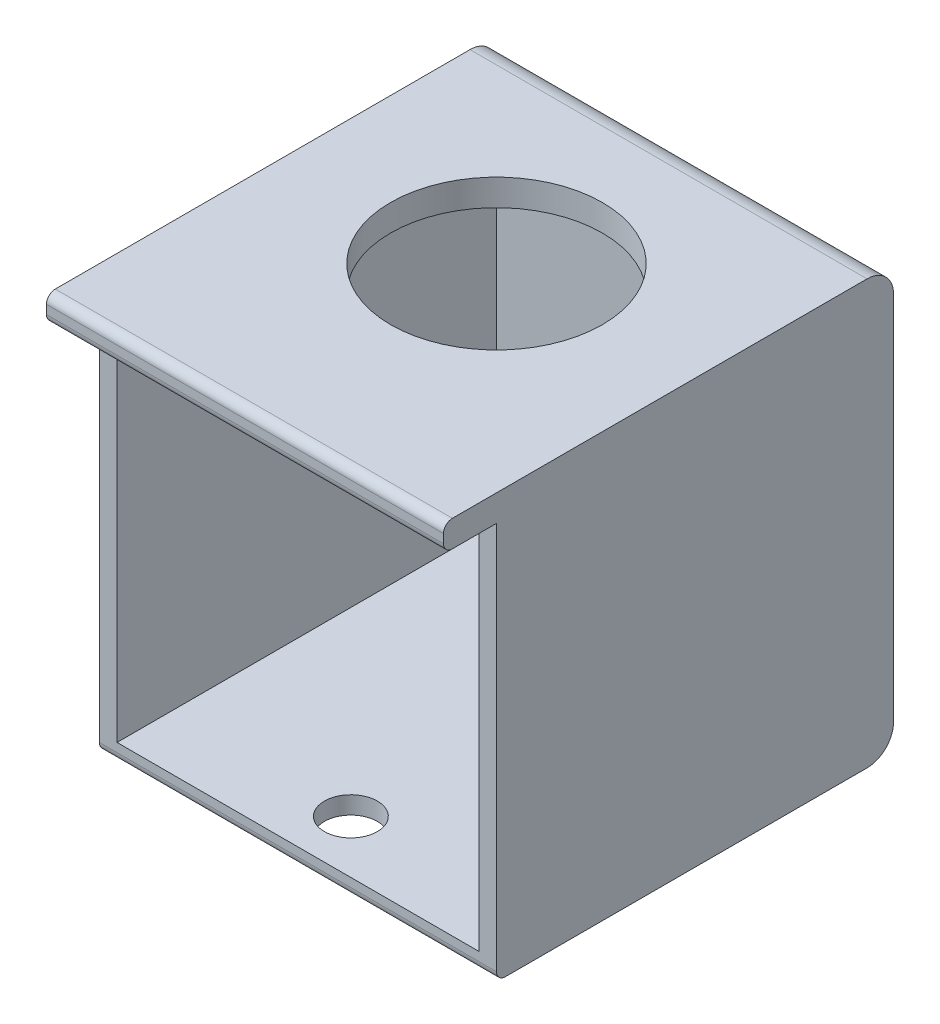
ISO-10303-21;
HEADER;
FILE_DESCRIPTION(('STEP AP214'),'2;1');
FILE_NAME('part.step','',(''),(''),'','','');
FILE_SCHEMA(('AUTOMOTIVE_DESIGN { 1 0 10303 214 1 1 1 1 }'));
ENDSEC;
DATA;
#1=APPLICATION_CONTEXT('core data for automotive mechanical design processes');
#2=APPLICATION_PROTOCOL_DEFINITION('international standard','automotive_design',2000,#1);
#3=PRODUCT_CONTEXT('',#1,'mechanical');
#4=PRODUCT('Part','Part','',(#3));
#5=PRODUCT_RELATED_PRODUCT_CATEGORY('part','',(#4));
#6=PRODUCT_DEFINITION_FORMATION('','',#4);
#7=PRODUCT_DEFINITION_CONTEXT('part definition',#1,'design');
#8=PRODUCT_DEFINITION('design','',#6,#7);
#9=PRODUCT_DEFINITION_SHAPE('','',#8);
#10=(LENGTH_UNIT() NAMED_UNIT(*) SI_UNIT(.MILLI.,.METRE.));
#11=(NAMED_UNIT(*) PLANE_ANGLE_UNIT() SI_UNIT($,.RADIAN.));
#12=(NAMED_UNIT(*) SI_UNIT($,.STERADIAN.) SOLID_ANGLE_UNIT());
#13=UNCERTAINTY_MEASURE_WITH_UNIT(LENGTH_MEASURE(1.E-05),#10,'distance_accuracy_value','');
#14=(GEOMETRIC_REPRESENTATION_CONTEXT(3) GLOBAL_UNCERTAINTY_ASSIGNED_CONTEXT((#13)) GLOBAL_UNIT_ASSIGNED_CONTEXT((#10,
#11,#12)) REPRESENTATION_CONTEXT('',''));
#15=CARTESIAN_POINT('',(0.,0.,0.));
#16=DIRECTION('',(0.,0.,1.));
#17=DIRECTION('',(1.,0.,0.));
#18=AXIS2_PLACEMENT_3D('',#15,#16,#17);
#19=CARTESIAN_POINT('',(-22.5,3.,22.5));
#20=DIRECTION('',(0.,0.,-1.));
#21=DIRECTION('',(-1.,0.,0.));
#22=AXIS2_PLACEMENT_3D('',#19,#20,#21);
#23=PLANE('',#22);
#24=DIRECTION('',(0.,-1.,0.));
#25=VECTOR('',#24,1.);
#26=CARTESIAN_POINT('',(-22.5,3.,22.5));
#27=LINE('',#26,#25);
#28=CARTESIAN_POINT('',(-22.5,0.,22.5));
#29=VERTEX_POINT('',#28);
#30=CARTESIAN_POINT('',(-22.5,-44.,22.5));
#31=VERTEX_POINT('',#30);
#32=EDGE_CURVE('E159',#29,#31,#27,.T.);
#33=ORIENTED_EDGE('',*,*,#32,.T.);
#34=DIRECTION('',(-1.,0.,0.));
#35=VECTOR('',#34,1.);
#36=CARTESIAN_POINT('',(22.5,-44.,22.5));
#37=LINE('',#36,#35);
#38=CARTESIAN_POINT('',(22.5,-44.,22.5));
#39=VERTEX_POINT('',#38);
#40=EDGE_CURVE('E46',#31,#39,#37,.F.);
#41=ORIENTED_EDGE('',*,*,#40,.T.);
#42=DIRECTION('',(0.,-1.,0.));
#43=VECTOR('',#42,1.);
#44=CARTESIAN_POINT('',(22.5,3.,22.5));
#45=LINE('',#44,#43);
#46=CARTESIAN_POINT('',(22.5,0.,22.5));
#47=VERTEX_POINT('',#46);
#48=EDGE_CURVE('E146',#47,#39,#45,.T.);
#49=ORIENTED_EDGE('',*,*,#48,.F.);
#50=DIRECTION('',(1.,0.,0.));
#51=VECTOR('',#50,1.);
#52=CARTESIAN_POINT('',(-22.5,0.,22.5));
#53=LINE('',#52,#51);
#54=CARTESIAN_POINT('',(20.5,0.,22.5));
#55=VERTEX_POINT('',#54);
#56=EDGE_CURVE('E157',#55,#47,#53,.T.);
#57=ORIENTED_EDGE('',*,*,#56,.F.);
#58=DIRECTION('',(0.,1.,0.));
#59=VECTOR('',#58,1.);
#60=CARTESIAN_POINT('',(20.5,-45.,22.5));
#61=LINE('',#60,#59);
#62=CARTESIAN_POINT('',(20.5,-43.,22.5));
#63=VERTEX_POINT('',#62);
#64=EDGE_CURVE('E255',#63,#55,#61,.T.);
#65=ORIENTED_EDGE('',*,*,#64,.F.);
#66=DIRECTION('',(-1.,0.,0.));
#67=VECTOR('',#66,1.);
#68=CARTESIAN_POINT('',(-20.5,-43.,22.5));
#69=LINE('',#68,#67);
#70=CARTESIAN_POINT('',(-20.5,-43.,22.5));
#71=VERTEX_POINT('',#70);
#72=EDGE_CURVE('E303',#63,#71,#69,.T.);
#73=ORIENTED_EDGE('',*,*,#72,.T.);
#74=DIRECTION('',(0.,1.,0.));
#75=VECTOR('',#74,1.);
#76=CARTESIAN_POINT('',(-20.5,-45.,22.5));
#77=LINE('',#76,#75);
#78=CARTESIAN_POINT('',(-20.5,0.,22.5));
#79=VERTEX_POINT('',#78);
#80=EDGE_CURVE('E249',#71,#79,#77,.T.);
#81=ORIENTED_EDGE('',*,*,#80,.T.);
#82=EDGE_CURVE('E170',#29,#79,#53,.T.);
#83=ORIENTED_EDGE('',*,*,#82,.F.);
#84=EDGE_LOOP('',(#33,#41,#49,#57,#65,#73,#81,#83));
#85=FACE_BOUND('',#84,.T.);
#86=ADVANCED_FACE('F38',(#85),#23,.F.);
#87=CARTESIAN_POINT('',(-20.5,-45.,22.5));
#88=DIRECTION('',(-1.,0.,0.));
#89=DIRECTION('',(0.,0.,1.));
#90=AXIS2_PLACEMENT_3D('',#87,#88,#89);
#91=PLANE('',#90);
#92=DIRECTION('',(0.,0.,-1.));
#93=VECTOR('',#92,1.);
#94=CARTESIAN_POINT('',(-20.5,-43.,22.5));
#95=LINE('',#94,#93);
#96=CARTESIAN_POINT('',(-20.5,-43.,-20.5));
#97=VERTEX_POINT('',#96);
#98=EDGE_CURVE('E300',#71,#97,#95,.T.);
#99=ORIENTED_EDGE('',*,*,#98,.T.);
#100=DIRECTION('',(0.,1.,0.));
#101=VECTOR('',#100,1.);
#102=CARTESIAN_POINT('',(-20.5,-45.,-20.5));
#103=LINE('',#102,#101);
#104=CARTESIAN_POINT('',(-20.5,0.,-20.5));
#105=VERTEX_POINT('',#104);
#106=EDGE_CURVE('E292',#97,#105,#103,.T.);
#107=ORIENTED_EDGE('',*,*,#106,.T.);
#108=DIRECTION('',(0.,0.,1.));
#109=VECTOR('',#108,1.);
#110=CARTESIAN_POINT('',(-20.5,0.,22.5));
#111=LINE('',#110,#109);
#112=EDGE_CURVE('E250',#105,#79,#111,.T.);
#113=ORIENTED_EDGE('',*,*,#112,.T.);
#114=ORIENTED_EDGE('',*,*,#80,.F.);
#115=EDGE_LOOP('',(#99,#107,#113,#114));
#116=FACE_BOUND('',#115,.T.);
#117=ADVANCED_FACE('F314',(#116),#91,.F.);
#118=CARTESIAN_POINT('',(20.5,-45.,22.5));
#119=DIRECTION('',(-1.,0.,0.));
#120=DIRECTION('',(0.,0.,1.));
#121=AXIS2_PLACEMENT_3D('',#118,#119,#120);
#122=PLANE('',#121);
#123=DIRECTION('',(0.,1.,0.));
#124=VECTOR('',#123,1.);
#125=CARTESIAN_POINT('',(20.5,-45.,-20.5));
#126=LINE('',#125,#124);
#127=CARTESIAN_POINT('',(20.5,-43.,-20.5));
#128=VERTEX_POINT('',#127);
#129=CARTESIAN_POINT('',(20.5,0.,-20.5));
#130=VERTEX_POINT('',#129);
#131=EDGE_CURVE('E288',#128,#130,#126,.T.);
#132=ORIENTED_EDGE('',*,*,#131,.F.);
#133=DIRECTION('',(0.,0.,-1.));
#134=VECTOR('',#133,1.);
#135=CARTESIAN_POINT('',(20.5,-43.,22.5));
#136=LINE('',#135,#134);
#137=EDGE_CURVE('E297',#63,#128,#136,.T.);
#138=ORIENTED_EDGE('',*,*,#137,.F.);
#139=ORIENTED_EDGE('',*,*,#64,.T.);
#140=DIRECTION('',(0.,0.,1.));
#141=VECTOR('',#140,1.);
#142=CARTESIAN_POINT('',(20.5,0.,22.5));
#143=LINE('',#142,#141);
#144=EDGE_CURVE('E166',#130,#55,#143,.T.);
#145=ORIENTED_EDGE('',*,*,#144,.F.);
#146=EDGE_LOOP('',(#132,#138,#139,#145));
#147=FACE_BOUND('',#146,.T.);
#148=ADVANCED_FACE('F319',(#147),#122,.T.);
#149=CARTESIAN_POINT('',(-20.5,-45.,-20.5));
#150=DIRECTION('',(0.,0.,-1.));
#151=DIRECTION('',(-1.,0.,0.));
#152=AXIS2_PLACEMENT_3D('',#149,#150,#151);
#153=PLANE('',#152);
#154=DIRECTION('',(-1.,0.,0.));
#155=VECTOR('',#154,1.);
#156=CARTESIAN_POINT('',(-20.5,-43.,-20.5));
#157=LINE('',#156,#155);
#158=EDGE_CURVE('E304',#128,#97,#157,.T.);
#159=ORIENTED_EDGE('',*,*,#158,.F.);
#160=ORIENTED_EDGE('',*,*,#131,.T.);
#161=DIRECTION('',(-1.,0.,0.));
#162=VECTOR('',#161,1.);
#163=CARTESIAN_POINT('',(-20.5,0.,-20.5));
#164=LINE('',#163,#162);
#165=EDGE_CURVE('E294',#130,#105,#164,.T.);
#166=ORIENTED_EDGE('',*,*,#165,.T.);
#167=ORIENTED_EDGE('',*,*,#106,.F.);
#168=EDGE_LOOP('',(#159,#160,#166,#167));
#169=FACE_BOUND('',#168,.T.);
#170=ADVANCED_FACE('F316',(#169),#153,.F.);
#171=CARTESIAN_POINT('',(0.,0.,0.));
#172=DIRECTION('',(0.,1.,0.));
#173=DIRECTION('',(0.,0.,1.));
#174=AXIS2_PLACEMENT_3D('',#171,#172,#173);
#175=PLANE('',#174);
#176=CARTESIAN_POINT('',(0.,0.,0.));
#177=DIRECTION('',(0.,1.,0.));
#178=DIRECTION('',(0.,0.,1.));
#179=AXIS2_PLACEMENT_3D('',#176,#177,#178);
#180=CIRCLE('',#179,12.);
#181=CARTESIAN_POINT('',(0.,0.,12.));
#182=VERTEX_POINT('',#181);
#183=EDGE_CURVE('E283',#182,#182,#180,.T.);
#184=ORIENTED_EDGE('',*,*,#183,.T.);
#185=EDGE_LOOP('',(#184));
#186=FACE_BOUND('',#185,.T.);
#187=DIRECTION('',(0.,0.,-1.));
#188=VECTOR('',#187,1.);
#189=CARTESIAN_POINT('',(22.5,0.,28.5));
#190=LINE('',#189,#188);
#191=CARTESIAN_POINT('',(22.5,0.,27.5));
#192=VERTEX_POINT('',#191);
#193=EDGE_CURVE('E144',#192,#47,#190,.T.);
#194=ORIENTED_EDGE('',*,*,#193,.F.);
#195=DIRECTION('',(1.,0.,0.));
#196=VECTOR('',#195,1.);
#197=CARTESIAN_POINT('',(-22.5,0.,27.5));
#198=LINE('',#197,#196);
#199=CARTESIAN_POINT('',(-22.5,0.,27.5));
#200=VERTEX_POINT('',#199);
#201=EDGE_CURVE('E209',#192,#200,#198,.F.);
#202=ORIENTED_EDGE('',*,*,#201,.T.);
#203=DIRECTION('',(0.,0.,-1.));
#204=VECTOR('',#203,1.);
#205=CARTESIAN_POINT('',(-22.5,0.,28.5));
#206=LINE('',#205,#204);
#207=EDGE_CURVE('E153',#200,#29,#206,.T.);
#208=ORIENTED_EDGE('',*,*,#207,.T.);
#209=ORIENTED_EDGE('',*,*,#82,.T.);
#210=ORIENTED_EDGE('',*,*,#112,.F.);
#211=ORIENTED_EDGE('',*,*,#165,.F.);
#212=ORIENTED_EDGE('',*,*,#144,.T.);
#213=ORIENTED_EDGE('',*,*,#56,.T.);
#214=EDGE_LOOP('',(#194,#202,#208,#209,#210,#211,#212,#213));
#215=FACE_BOUND('',#214,.T.);
#216=ADVANCED_FACE('F163',(#186,#215),#175,.F.);
#217=CARTESIAN_POINT('',(22.5,3.,-22.5));
#218=DIRECTION('',(-1.,0.,0.));
#219=DIRECTION('',(0.,0.,1.));
#220=AXIS2_PLACEMENT_3D('',#217,#218,#219);
#221=PLANE('',#220);
#222=ORIENTED_EDGE('',*,*,#48,.T.);
#223=CARTESIAN_POINT('',(22.5,-44.,21.5));
#224=DIRECTION('',(-1.,0.,0.));
#225=DIRECTION('',(0.,0.,1.));
#226=AXIS2_PLACEMENT_3D('',#223,#224,#225);
#227=CIRCLE('',#226,1.);
#228=CARTESIAN_POINT('',(22.5,-45.,21.5));
#229=VERTEX_POINT('',#228);
#230=EDGE_CURVE('E11',#39,#229,#227,.F.);
#231=ORIENTED_EDGE('',*,*,#230,.T.);
#232=DIRECTION('',(0.,0.,-1.));
#233=VECTOR('',#232,1.);
#234=CARTESIAN_POINT('',(22.5,-45.,22.5));
#235=LINE('',#234,#233);
#236=CARTESIAN_POINT('',(22.5,-45.,-19.5));
#237=VERTEX_POINT('',#236);
#238=EDGE_CURVE('E243',#229,#237,#235,.T.);
#239=ORIENTED_EDGE('',*,*,#238,.T.);
#240=CARTESIAN_POINT('',(22.5,-42.,-19.5));
#241=DIRECTION('',(-1.,0.,0.));
#242=DIRECTION('',(0.,0.,1.));
#243=AXIS2_PLACEMENT_3D('',#240,#241,#242);
#244=CIRCLE('',#243,3.);
#245=CARTESIAN_POINT('',(22.5,-42.,-22.5));
#246=VERTEX_POINT('',#245);
#247=EDGE_CURVE('E221',#237,#246,#244,.F.);
#248=ORIENTED_EDGE('',*,*,#247,.T.);
#249=DIRECTION('',(0.,-1.,0.));
#250=VECTOR('',#249,1.);
#251=CARTESIAN_POINT('',(22.5,3.,-22.5));
#252=LINE('',#251,#250);
#253=CARTESIAN_POINT('',(22.5,0.,-22.5));
#254=VERTEX_POINT('',#253);
#255=EDGE_CURVE('E168',#254,#246,#252,.T.);
#256=ORIENTED_EDGE('',*,*,#255,.F.);
#257=CARTESIAN_POINT('',(22.5,0.,-19.5));
#258=DIRECTION('',(-1.,0.,0.));
#259=DIRECTION('',(0.,0.,1.));
#260=AXIS2_PLACEMENT_3D('',#257,#258,#259);
#261=CIRCLE('',#260,3.);
#262=CARTESIAN_POINT('',(22.5,3.,-19.5));
#263=VERTEX_POINT('',#262);
#264=EDGE_CURVE('E219',#254,#263,#261,.F.);
#265=ORIENTED_EDGE('',*,*,#264,.T.);
#266=DIRECTION('',(0.,0.,-1.));
#267=VECTOR('',#266,1.);
#268=CARTESIAN_POINT('',(22.5,3.,-22.5));
#269=LINE('',#268,#267);
#270=CARTESIAN_POINT('',(22.5,3.,27.5));
#271=VERTEX_POINT('',#270);
#272=EDGE_CURVE('E252',#271,#263,#269,.T.);
#273=ORIENTED_EDGE('',*,*,#272,.F.);
#274=CARTESIAN_POINT('',(22.5,2.,27.5));
#275=DIRECTION('',(-1.,0.,0.));
#276=DIRECTION('',(0.,0.,1.));
#277=AXIS2_PLACEMENT_3D('',#274,#275,#276);
#278=CIRCLE('',#277,1.);
#279=CARTESIAN_POINT('',(22.5,2.,28.5));
#280=VERTEX_POINT('',#279);
#281=EDGE_CURVE('E203',#271,#280,#278,.F.);
#282=ORIENTED_EDGE('',*,*,#281,.T.);
#283=DIRECTION('',(0.,1.,0.));
#284=VECTOR('',#283,1.);
#285=CARTESIAN_POINT('',(22.5,3.,28.5));
#286=LINE('',#285,#284);
#287=CARTESIAN_POINT('',(22.5,1.,28.5));
#288=VERTEX_POINT('',#287);
#289=EDGE_CURVE('E154',#288,#280,#286,.T.);
#290=ORIENTED_EDGE('',*,*,#289,.F.);
#291=CARTESIAN_POINT('',(22.5,1.,27.5));
#292=DIRECTION('',(-1.,0.,0.));
#293=DIRECTION('',(0.,0.,1.));
#294=AXIS2_PLACEMENT_3D('',#291,#292,#293);
#295=CIRCLE('',#294,1.);
#296=EDGE_CURVE('E149',#288,#192,#295,.F.);
#297=ORIENTED_EDGE('',*,*,#296,.T.);
#298=ORIENTED_EDGE('',*,*,#193,.T.);
#299=EDGE_LOOP('',(#222,#231,#239,#248,#256,#265,#273,#282,#290,#297,#298));
#300=FACE_BOUND('',#299,.T.);
#301=ADVANCED_FACE('F145',(#300),#221,.F.);
#302=CARTESIAN_POINT('',(-22.5,3.,-22.5));
#303=DIRECTION('',(0.,0.,1.));
#304=DIRECTION('',(1.,0.,0.));
#305=AXIS2_PLACEMENT_3D('',#302,#303,#304);
#306=PLANE('',#305);
#307=ORIENTED_EDGE('',*,*,#255,.T.);
#308=DIRECTION('',(1.,0.,0.));
#309=VECTOR('',#308,1.);
#310=CARTESIAN_POINT('',(-22.5,-42.,-22.5));
#311=LINE('',#310,#309);
#312=CARTESIAN_POINT('',(-22.5,-42.,-22.5));
#313=VERTEX_POINT('',#312);
#314=EDGE_CURVE('E225',#246,#313,#311,.F.);
#315=ORIENTED_EDGE('',*,*,#314,.T.);
#316=DIRECTION('',(0.,-1.,0.));
#317=VECTOR('',#316,1.);
#318=CARTESIAN_POINT('',(-22.5,3.,-22.5));
#319=LINE('',#318,#317);
#320=CARTESIAN_POINT('',(-22.5,0.,-22.5));
#321=VERTEX_POINT('',#320);
#322=EDGE_CURVE('E175',#321,#313,#319,.T.);
#323=ORIENTED_EDGE('',*,*,#322,.F.);
#324=DIRECTION('',(-1.,0.,0.));
#325=VECTOR('',#324,1.);
#326=CARTESIAN_POINT('',(22.5,0.,-22.5));
#327=LINE('',#326,#325);
#328=EDGE_CURVE('E223',#321,#254,#327,.F.);
#329=ORIENTED_EDGE('',*,*,#328,.T.);
#330=EDGE_LOOP('',(#307,#315,#323,#329));
#331=FACE_BOUND('',#330,.T.);
#332=ADVANCED_FACE('F277',(#331),#306,.F.);
#333=CARTESIAN_POINT('',(-22.5,3.,-22.5));
#334=DIRECTION('',(1.,0.,0.));
#335=DIRECTION('',(0.,0.,-1.));
#336=AXIS2_PLACEMENT_3D('',#333,#334,#335);
#337=PLANE('',#336);
#338=DIRECTION('',(0.,0.,-1.));
#339=VECTOR('',#338,1.);
#340=CARTESIAN_POINT('',(-22.5,-45.,22.5));
#341=LINE('',#340,#339);
#342=CARTESIAN_POINT('',(-22.5,-45.,21.5));
#343=VERTEX_POINT('',#342);
#344=CARTESIAN_POINT('',(-22.5,-45.,-19.5));
#345=VERTEX_POINT('',#344);
#346=EDGE_CURVE('E242',#343,#345,#341,.T.);
#347=ORIENTED_EDGE('',*,*,#346,.F.);
#348=CARTESIAN_POINT('',(-22.5,-44.,21.5));
#349=DIRECTION('',(1.,0.,0.));
#350=DIRECTION('',(0.,0.,-1.));
#351=AXIS2_PLACEMENT_3D('',#348,#349,#350);
#352=CIRCLE('',#351,1.);
#353=EDGE_CURVE('E60',#343,#31,#352,.F.);
#354=ORIENTED_EDGE('',*,*,#353,.T.);
#355=ORIENTED_EDGE('',*,*,#32,.F.);
#356=ORIENTED_EDGE('',*,*,#207,.F.);
#357=CARTESIAN_POINT('',(-22.5,1.,27.5));
#358=DIRECTION('',(1.,0.,0.));
#359=DIRECTION('',(0.,0.,-1.));
#360=AXIS2_PLACEMENT_3D('',#357,#358,#359);
#361=CIRCLE('',#360,1.);
#362=CARTESIAN_POINT('',(-22.5,1.,28.5));
#363=VERTEX_POINT('',#362);
#364=EDGE_CURVE('E208',#200,#363,#361,.F.);
#365=ORIENTED_EDGE('',*,*,#364,.T.);
#366=DIRECTION('',(0.,-1.,0.));
#367=VECTOR('',#366,1.);
#368=CARTESIAN_POINT('',(-22.5,3.,28.5));
#369=LINE('',#368,#367);
#370=CARTESIAN_POINT('',(-22.5,2.,28.5));
#371=VERTEX_POINT('',#370);
#372=EDGE_CURVE('E179',#371,#363,#369,.T.);
#373=ORIENTED_EDGE('',*,*,#372,.F.);
#374=CARTESIAN_POINT('',(-22.5,2.,27.5));
#375=DIRECTION('',(1.,0.,0.));
#376=DIRECTION('',(0.,0.,-1.));
#377=AXIS2_PLACEMENT_3D('',#374,#375,#376);
#378=CIRCLE('',#377,1.);
#379=CARTESIAN_POINT('',(-22.5,3.,27.5));
#380=VERTEX_POINT('',#379);
#381=EDGE_CURVE('E205',#371,#380,#378,.F.);
#382=ORIENTED_EDGE('',*,*,#381,.T.);
#383=DIRECTION('',(0.,0.,1.));
#384=VECTOR('',#383,1.);
#385=CARTESIAN_POINT('',(-22.5,3.,-22.5));
#386=LINE('',#385,#384);
#387=CARTESIAN_POINT('',(-22.5,3.,-19.5));
#388=VERTEX_POINT('',#387);
#389=EDGE_CURVE('E160',#388,#380,#386,.T.);
#390=ORIENTED_EDGE('',*,*,#389,.F.);
#391=CARTESIAN_POINT('',(-22.5,0.,-19.5));
#392=DIRECTION('',(1.,0.,0.));
#393=DIRECTION('',(0.,0.,-1.));
#394=AXIS2_PLACEMENT_3D('',#391,#392,#393);
#395=CIRCLE('',#394,3.);
#396=EDGE_CURVE('E227',#388,#321,#395,.F.);
#397=ORIENTED_EDGE('',*,*,#396,.T.);
#398=ORIENTED_EDGE('',*,*,#322,.T.);
#399=CARTESIAN_POINT('',(-22.5,-42.,-19.5));
#400=DIRECTION('',(1.,0.,0.));
#401=DIRECTION('',(0.,0.,-1.));
#402=AXIS2_PLACEMENT_3D('',#399,#400,#401);
#403=CIRCLE('',#402,3.);
#404=EDGE_CURVE('E229',#313,#345,#403,.F.);
#405=ORIENTED_EDGE('',*,*,#404,.T.);
#406=EDGE_LOOP('',(#347,#354,#355,#356,#365,#373,#382,#390,#397,#398,#405));
#407=FACE_BOUND('',#406,.T.);
#408=ADVANCED_FACE('F245',(#407),#337,.F.);
#409=CARTESIAN_POINT('',(0.,3.,0.));
#410=DIRECTION('',(0.,1.,0.));
#411=DIRECTION('',(0.,0.,1.));
#412=AXIS2_PLACEMENT_3D('',#409,#410,#411);
#413=PLANE('',#412);
#414=CARTESIAN_POINT('',(0.,3.,0.));
#415=DIRECTION('',(0.,1.,0.));
#416=DIRECTION('',(0.,0.,1.));
#417=AXIS2_PLACEMENT_3D('',#414,#415,#416);
#418=CIRCLE('',#417,12.);
#419=CARTESIAN_POINT('',(0.,3.,12.));
#420=VERTEX_POINT('',#419);
#421=EDGE_CURVE('E285',#420,#420,#418,.T.);
#422=ORIENTED_EDGE('',*,*,#421,.F.);
#423=EDGE_LOOP('',(#422));
#424=FACE_BOUND('',#423,.T.);
#425=ORIENTED_EDGE('',*,*,#272,.T.);
#426=DIRECTION('',(-1.,0.,0.));
#427=VECTOR('',#426,1.);
#428=CARTESIAN_POINT('',(-22.5,3.,-19.5));
#429=LINE('',#428,#427);
#430=EDGE_CURVE('E232',#263,#388,#429,.T.);
#431=ORIENTED_EDGE('',*,*,#430,.T.);
#432=ORIENTED_EDGE('',*,*,#389,.T.);
#433=DIRECTION('',(-1.,0.,0.));
#434=VECTOR('',#433,1.);
#435=CARTESIAN_POINT('',(0.,3.,27.5));
#436=LINE('',#435,#434);
#437=EDGE_CURVE('E206',#380,#271,#436,.F.);
#438=ORIENTED_EDGE('',*,*,#437,.T.);
#439=EDGE_LOOP('',(#425,#431,#432,#438));
#440=FACE_BOUND('',#439,.T.);
#441=ADVANCED_FACE('F271',(#424,#440),#413,.T.);
#442=CARTESIAN_POINT('',(0.,-45.,0.));
#443=DIRECTION('',(0.,-1.,0.));
#444=DIRECTION('',(0.,0.,-1.));
#445=AXIS2_PLACEMENT_3D('',#442,#443,#444);
#446=PLANE('',#445);
#447=CARTESIAN_POINT('',(0.,-45.,16.5));
#448=DIRECTION('',(0.,-1.,0.));
#449=DIRECTION('',(0.,0.,-1.));
#450=AXIS2_PLACEMENT_3D('',#447,#448,#449);
#451=CIRCLE('',#450,3.);
#452=CARTESIAN_POINT('',(0.,-45.,13.5));
#453=VERTEX_POINT('',#452);
#454=EDGE_CURVE('E186',#453,#453,#451,.T.);
#455=ORIENTED_EDGE('',*,*,#454,.F.);
#456=EDGE_LOOP('',(#455));
#457=FACE_BOUND('',#456,.T.);
#458=ORIENTED_EDGE('',*,*,#238,.F.);
#459=DIRECTION('',(-1.,0.,0.));
#460=VECTOR('',#459,1.);
#461=CARTESIAN_POINT('',(-22.5,-45.,21.5));
#462=LINE('',#461,#460);
#463=EDGE_CURVE('E235',#229,#343,#462,.T.);
#464=ORIENTED_EDGE('',*,*,#463,.T.);
#465=ORIENTED_EDGE('',*,*,#346,.T.);
#466=DIRECTION('',(1.,0.,0.));
#467=VECTOR('',#466,1.);
#468=CARTESIAN_POINT('',(22.5,-45.,-19.5));
#469=LINE('',#468,#467);
#470=EDGE_CURVE('E216',#345,#237,#469,.T.);
#471=ORIENTED_EDGE('',*,*,#470,.T.);
#472=EDGE_LOOP('',(#458,#464,#465,#471));
#473=FACE_BOUND('',#472,.T.);
#474=ADVANCED_FACE('F241',(#457,#473),#446,.T.);
#475=CARTESIAN_POINT('',(0.,0.,0.));
#476=DIRECTION('',(0.,1.,0.));
#477=DIRECTION('',(0.,0.,1.));
#478=AXIS2_PLACEMENT_3D('',#475,#476,#477);
#479=CYLINDRICAL_SURFACE('',#478,12.);
#480=ORIENTED_EDGE('',*,*,#183,.F.);
#481=EDGE_LOOP('',(#480));
#482=FACE_BOUND('',#481,.T.);
#483=ORIENTED_EDGE('',*,*,#421,.T.);
#484=EDGE_LOOP('',(#483));
#485=FACE_BOUND('',#484,.T.);
#486=ADVANCED_FACE('F323',(#482,#485),#479,.F.);
#487=CARTESIAN_POINT('',(-20.5,-43.,22.5));
#488=DIRECTION('',(0.,-1.,0.));
#489=DIRECTION('',(1.,0.,0.));
#490=AXIS2_PLACEMENT_3D('',#487,#488,#489);
#491=PLANE('',#490);
#492=CARTESIAN_POINT('',(0.,-43.,16.5));
#493=DIRECTION('',(0.,-1.,0.));
#494=DIRECTION('',(0.,0.,-1.));
#495=AXIS2_PLACEMENT_3D('',#492,#493,#494);
#496=CIRCLE('',#495,3.);
#497=CARTESIAN_POINT('',(0.,-43.,13.5));
#498=VERTEX_POINT('',#497);
#499=EDGE_CURVE('E180',#498,#498,#496,.T.);
#500=ORIENTED_EDGE('',*,*,#499,.T.);
#501=EDGE_LOOP('',(#500));
#502=FACE_BOUND('',#501,.T.);
#503=ORIENTED_EDGE('',*,*,#158,.T.);
#504=ORIENTED_EDGE('',*,*,#98,.F.);
#505=ORIENTED_EDGE('',*,*,#72,.F.);
#506=ORIENTED_EDGE('',*,*,#137,.T.);
#507=EDGE_LOOP('',(#503,#504,#505,#506));
#508=FACE_BOUND('',#507,.T.);
#509=ADVANCED_FACE('F321',(#502,#508),#491,.F.);
#510=CARTESIAN_POINT('',(0.,0.,28.5));
#511=DIRECTION('',(0.,0.,1.));
#512=DIRECTION('',(1.,0.,0.));
#513=AXIS2_PLACEMENT_3D('',#510,#511,#512);
#514=PLANE('',#513);
#515=ORIENTED_EDGE('',*,*,#372,.T.);
#516=DIRECTION('',(1.,0.,0.));
#517=VECTOR('',#516,1.);
#518=CARTESIAN_POINT('',(22.5,1.,28.5));
#519=LINE('',#518,#517);
#520=EDGE_CURVE('E172',#363,#288,#519,.T.);
#521=ORIENTED_EDGE('',*,*,#520,.T.);
#522=ORIENTED_EDGE('',*,*,#289,.T.);
#523=DIRECTION('',(-1.,0.,0.));
#524=VECTOR('',#523,1.);
#525=CARTESIAN_POINT('',(0.,2.,28.5));
#526=LINE('',#525,#524);
#527=EDGE_CURVE('E167',#280,#371,#526,.T.);
#528=ORIENTED_EDGE('',*,*,#527,.T.);
#529=EDGE_LOOP('',(#515,#521,#522,#528));
#530=FACE_BOUND('',#529,.T.);
#531=ADVANCED_FACE('F196',(#530),#514,.T.);
#532=CARTESIAN_POINT('',(0.,1.,27.5));
#533=DIRECTION('',(-1.,0.,0.));
#534=DIRECTION('',(0.,0.,1.));
#535=AXIS2_PLACEMENT_3D('',#532,#533,#534);
#536=CYLINDRICAL_SURFACE('',#535,1.);
#537=ORIENTED_EDGE('',*,*,#364,.F.);
#538=ORIENTED_EDGE('',*,*,#201,.F.);
#539=ORIENTED_EDGE('',*,*,#296,.F.);
#540=ORIENTED_EDGE('',*,*,#520,.F.);
#541=EDGE_LOOP('',(#537,#538,#539,#540));
#542=FACE_BOUND('',#541,.T.);
#543=ADVANCED_FACE('F329',(#542),#536,.T.);
#544=CARTESIAN_POINT('',(0.,2.,27.5));
#545=DIRECTION('',(-1.,0.,0.));
#546=DIRECTION('',(0.,0.,1.));
#547=AXIS2_PLACEMENT_3D('',#544,#545,#546);
#548=CYLINDRICAL_SURFACE('',#547,1.);
#549=ORIENTED_EDGE('',*,*,#281,.F.);
#550=ORIENTED_EDGE('',*,*,#437,.F.);
#551=ORIENTED_EDGE('',*,*,#381,.F.);
#552=ORIENTED_EDGE('',*,*,#527,.F.);
#553=EDGE_LOOP('',(#549,#550,#551,#552));
#554=FACE_BOUND('',#553,.T.);
#555=ADVANCED_FACE('F201',(#554),#548,.T.);
#556=CARTESIAN_POINT('',(0.,-42.,-19.5));
#557=DIRECTION('',(-1.,0.,0.));
#558=DIRECTION('',(0.,0.,1.));
#559=AXIS2_PLACEMENT_3D('',#556,#557,#558);
#560=CYLINDRICAL_SURFACE('',#559,3.);
#561=ORIENTED_EDGE('',*,*,#404,.F.);
#562=ORIENTED_EDGE('',*,*,#314,.F.);
#563=ORIENTED_EDGE('',*,*,#247,.F.);
#564=ORIENTED_EDGE('',*,*,#470,.F.);
#565=EDGE_LOOP('',(#561,#562,#563,#564));
#566=FACE_BOUND('',#565,.T.);
#567=ADVANCED_FACE('F281',(#566),#560,.T.);
#568=CARTESIAN_POINT('',(0.,0.,-19.5));
#569=DIRECTION('',(1.,0.,0.));
#570=DIRECTION('',(0.,0.,-1.));
#571=AXIS2_PLACEMENT_3D('',#568,#569,#570);
#572=CYLINDRICAL_SURFACE('',#571,3.);
#573=ORIENTED_EDGE('',*,*,#264,.F.);
#574=ORIENTED_EDGE('',*,*,#328,.F.);
#575=ORIENTED_EDGE('',*,*,#396,.F.);
#576=ORIENTED_EDGE('',*,*,#430,.F.);
#577=EDGE_LOOP('',(#573,#574,#575,#576));
#578=FACE_BOUND('',#577,.T.);
#579=ADVANCED_FACE('F273',(#578),#572,.T.);
#580=CARTESIAN_POINT('',(0.,-43.,16.5));
#581=DIRECTION('',(0.,-1.,0.));
#582=DIRECTION('',(0.,0.,-1.));
#583=AXIS2_PLACEMENT_3D('',#580,#581,#582);
#584=CYLINDRICAL_SURFACE('',#583,3.);
#585=ORIENTED_EDGE('',*,*,#499,.F.);
#586=EDGE_LOOP('',(#585));
#587=FACE_BOUND('',#586,.T.);
#588=ORIENTED_EDGE('',*,*,#454,.T.);
#589=EDGE_LOOP('',(#588));
#590=FACE_BOUND('',#589,.T.);
#591=ADVANCED_FACE('F356',(#587,#590),#584,.F.);
#592=CARTESIAN_POINT('',(0.,-44.,21.5));
#593=DIRECTION('',(1.,0.,0.));
#594=DIRECTION('',(0.,0.,-1.));
#595=AXIS2_PLACEMENT_3D('',#592,#593,#594);
#596=CYLINDRICAL_SURFACE('',#595,1.);
#597=ORIENTED_EDGE('',*,*,#230,.F.);
#598=ORIENTED_EDGE('',*,*,#40,.F.);
#599=ORIENTED_EDGE('',*,*,#353,.F.);
#600=ORIENTED_EDGE('',*,*,#463,.F.);
#601=EDGE_LOOP('',(#597,#598,#599,#600));
#602=FACE_BOUND('',#601,.T.);
#603=ADVANCED_FACE('F40',(#602),#596,.T.);
#604=CLOSED_SHELL('',(#86,#117,#148,#170,#216,#301,#332,#408,#441,#474,#486,#509,#531,#543,#555,
#567,#579,#591,#603));
#605=MANIFOLD_SOLID_BREP('B2',#604);
#606=ADVANCED_BREP_SHAPE_REPRESENTATION('',(#18,#605),#14);
#607=SHAPE_DEFINITION_REPRESENTATION(#9,#606);
ENDSEC;
END-ISO-10303-21;
